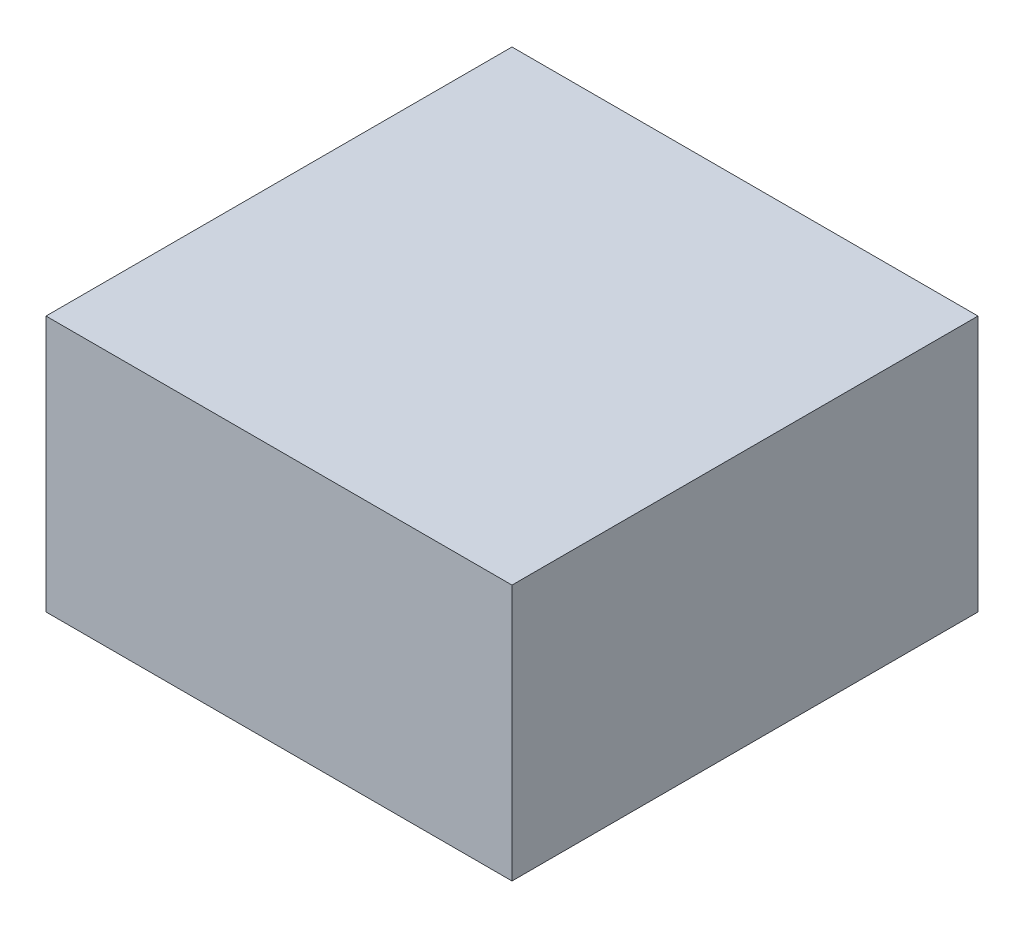
ISO-10303-21;
HEADER;
FILE_DESCRIPTION(('STEP AP214'),'2;1');
FILE_NAME('part.step','',(''),(''),'','','');
FILE_SCHEMA(('AUTOMOTIVE_DESIGN { 1 0 10303 214 1 1 1 1 }'));
ENDSEC;
DATA;
#1=APPLICATION_CONTEXT('core data for automotive mechanical design processes');
#2=APPLICATION_PROTOCOL_DEFINITION('international standard','automotive_design',2000,#1);
#3=PRODUCT_CONTEXT('',#1,'mechanical');
#4=PRODUCT('Part','Part','',(#3));
#5=PRODUCT_RELATED_PRODUCT_CATEGORY('part','',(#4));
#6=PRODUCT_DEFINITION_FORMATION('','',#4);
#7=PRODUCT_DEFINITION_CONTEXT('part definition',#1,'design');
#8=PRODUCT_DEFINITION('design','',#6,#7);
#9=PRODUCT_DEFINITION_SHAPE('','',#8);
#10=(LENGTH_UNIT() NAMED_UNIT(*) SI_UNIT(.MILLI.,.METRE.));
#11=(NAMED_UNIT(*) PLANE_ANGLE_UNIT() SI_UNIT($,.RADIAN.));
#12=(NAMED_UNIT(*) SI_UNIT($,.STERADIAN.) SOLID_ANGLE_UNIT());
#13=UNCERTAINTY_MEASURE_WITH_UNIT(LENGTH_MEASURE(1.E-05),#10,'distance_accuracy_value','');
#14=(GEOMETRIC_REPRESENTATION_CONTEXT(3) GLOBAL_UNCERTAINTY_ASSIGNED_CONTEXT((#13)) GLOBAL_UNIT_ASSIGNED_CONTEXT((#10,
#11,#12)) REPRESENTATION_CONTEXT('',''));
#15=CARTESIAN_POINT('',(0.,0.,0.));
#16=DIRECTION('',(0.,0.,1.));
#17=DIRECTION('',(1.,0.,0.));
#18=AXIS2_PLACEMENT_3D('',#15,#16,#17);
#19=CARTESIAN_POINT('',(0.5,0.55,-0.499999999999999));
#20=DIRECTION('',(-1.,0.,0.));
#21=DIRECTION('',(0.,0.,1.));
#22=AXIS2_PLACEMENT_3D('',#19,#20,#21);
#23=PLANE('',#22);
#24=DIRECTION('',(0.,0.,-1.));
#25=VECTOR('',#24,1.);
#26=CARTESIAN_POINT('',(0.5,0.,-0.499999999999999));
#27=LINE('',#26,#25);
#28=CARTESIAN_POINT('',(0.5,0.,0.500000000000001));
#29=VERTEX_POINT('',#28);
#30=CARTESIAN_POINT('',(0.5,0.,-0.499999999999999));
#31=VERTEX_POINT('',#30);
#32=EDGE_CURVE('E105',#29,#31,#27,.T.);
#33=ORIENTED_EDGE('',*,*,#32,.T.);
#34=DIRECTION('',(0.,-1.,0.));
#35=VECTOR('',#34,1.);
#36=CARTESIAN_POINT('',(0.5,0.55,-0.499999999999999));
#37=LINE('',#36,#35);
#38=CARTESIAN_POINT('',(0.5,0.55,-0.499999999999999));
#39=VERTEX_POINT('',#38);
#40=EDGE_CURVE('E11',#39,#31,#37,.T.);
#41=ORIENTED_EDGE('',*,*,#40,.F.);
#42=DIRECTION('',(0.,0.,-1.));
#43=VECTOR('',#42,1.);
#44=CARTESIAN_POINT('',(0.5,0.55,-0.499999999999999));
#45=LINE('',#44,#43);
#46=CARTESIAN_POINT('',(0.5,0.55,0.500000000000001));
#47=VERTEX_POINT('',#46);
#48=EDGE_CURVE('E88',#47,#39,#45,.T.);
#49=ORIENTED_EDGE('',*,*,#48,.F.);
#50=DIRECTION('',(0.,-1.,0.));
#51=VECTOR('',#50,1.);
#52=CARTESIAN_POINT('',(0.5,0.55,0.500000000000001));
#53=LINE('',#52,#51);
#54=EDGE_CURVE('E101',#47,#29,#53,.T.);
#55=ORIENTED_EDGE('',*,*,#54,.T.);
#56=EDGE_LOOP('',(#33,#41,#49,#55));
#57=FACE_BOUND('',#56,.T.);
#58=ADVANCED_FACE('F36',(#57),#23,.F.);
#59=CARTESIAN_POINT('',(-0.5,0.55,-0.499999999999999));
#60=DIRECTION('',(0.,0.,1.));
#61=DIRECTION('',(1.,0.,0.));
#62=AXIS2_PLACEMENT_3D('',#59,#60,#61);
#63=PLANE('',#62);
#64=DIRECTION('',(-1.,0.,0.));
#65=VECTOR('',#64,1.);
#66=CARTESIAN_POINT('',(-0.5,0.,-0.499999999999999));
#67=LINE('',#66,#65);
#68=CARTESIAN_POINT('',(-0.5,0.,-0.499999999999999));
#69=VERTEX_POINT('',#68);
#70=EDGE_CURVE('E93',#31,#69,#67,.T.);
#71=ORIENTED_EDGE('',*,*,#70,.T.);
#72=DIRECTION('',(0.,-1.,0.));
#73=VECTOR('',#72,1.);
#74=CARTESIAN_POINT('',(-0.5,0.55,-0.499999999999999));
#75=LINE('',#74,#73);
#76=CARTESIAN_POINT('',(-0.5,0.55,-0.499999999999999));
#77=VERTEX_POINT('',#76);
#78=EDGE_CURVE('E45',#77,#69,#75,.T.);
#79=ORIENTED_EDGE('',*,*,#78,.F.);
#80=DIRECTION('',(-1.,0.,0.));
#81=VECTOR('',#80,1.);
#82=CARTESIAN_POINT('',(-0.5,0.55,-0.499999999999999));
#83=LINE('',#82,#81);
#84=EDGE_CURVE('E83',#39,#77,#83,.T.);
#85=ORIENTED_EDGE('',*,*,#84,.F.);
#86=ORIENTED_EDGE('',*,*,#40,.T.);
#87=EDGE_LOOP('',(#71,#79,#85,#86));
#88=FACE_BOUND('',#87,.T.);
#89=ADVANCED_FACE('F92',(#88),#63,.F.);
#90=CARTESIAN_POINT('',(-0.5,0.55,-0.499999999999999));
#91=DIRECTION('',(1.,0.,0.));
#92=DIRECTION('',(0.,0.,-1.));
#93=AXIS2_PLACEMENT_3D('',#90,#91,#92);
#94=PLANE('',#93);
#95=DIRECTION('',(0.,0.,1.));
#96=VECTOR('',#95,1.);
#97=CARTESIAN_POINT('',(-0.5,0.,-0.499999999999999));
#98=LINE('',#97,#96);
#99=CARTESIAN_POINT('',(-0.5,0.,0.500000000000001));
#100=VERTEX_POINT('',#99);
#101=EDGE_CURVE('E70',#69,#100,#98,.T.);
#102=ORIENTED_EDGE('',*,*,#101,.T.);
#103=DIRECTION('',(0.,-1.,0.));
#104=VECTOR('',#103,1.);
#105=CARTESIAN_POINT('',(-0.5,0.55,0.500000000000001));
#106=LINE('',#105,#104);
#107=CARTESIAN_POINT('',(-0.5,0.55,0.500000000000001));
#108=VERTEX_POINT('',#107);
#109=EDGE_CURVE('E95',#108,#100,#106,.T.);
#110=ORIENTED_EDGE('',*,*,#109,.F.);
#111=DIRECTION('',(0.,0.,1.));
#112=VECTOR('',#111,1.);
#113=CARTESIAN_POINT('',(-0.5,0.55,-0.499999999999999));
#114=LINE('',#113,#112);
#115=EDGE_CURVE('E86',#77,#108,#114,.T.);
#116=ORIENTED_EDGE('',*,*,#115,.F.);
#117=ORIENTED_EDGE('',*,*,#78,.T.);
#118=EDGE_LOOP('',(#102,#110,#116,#117));
#119=FACE_BOUND('',#118,.T.);
#120=ADVANCED_FACE('F96',(#119),#94,.F.);
#121=CARTESIAN_POINT('',(-0.5,0.55,0.500000000000001));
#122=DIRECTION('',(0.,0.,-1.));
#123=DIRECTION('',(-1.,0.,0.));
#124=AXIS2_PLACEMENT_3D('',#121,#122,#123);
#125=PLANE('',#124);
#126=DIRECTION('',(1.,0.,0.));
#127=VECTOR('',#126,1.);
#128=CARTESIAN_POINT('',(-0.5,0.,0.500000000000001));
#129=LINE('',#128,#127);
#130=EDGE_CURVE('E76',#100,#29,#129,.T.);
#131=ORIENTED_EDGE('',*,*,#130,.T.);
#132=ORIENTED_EDGE('',*,*,#54,.F.);
#133=DIRECTION('',(1.,0.,0.));
#134=VECTOR('',#133,1.);
#135=CARTESIAN_POINT('',(-0.5,0.55,0.500000000000001));
#136=LINE('',#135,#134);
#137=EDGE_CURVE('E53',#108,#47,#136,.T.);
#138=ORIENTED_EDGE('',*,*,#137,.F.);
#139=ORIENTED_EDGE('',*,*,#109,.T.);
#140=EDGE_LOOP('',(#131,#132,#138,#139));
#141=FACE_BOUND('',#140,.T.);
#142=ADVANCED_FACE('F117',(#141),#125,.F.);
#143=CARTESIAN_POINT('',(0.,0.55,0.));
#144=DIRECTION('',(0.,1.,0.));
#145=DIRECTION('',(0.,0.,1.));
#146=AXIS2_PLACEMENT_3D('',#143,#144,#145);
#147=PLANE('',#146);
#148=ORIENTED_EDGE('',*,*,#48,.T.);
#149=ORIENTED_EDGE('',*,*,#84,.T.);
#150=ORIENTED_EDGE('',*,*,#115,.T.);
#151=ORIENTED_EDGE('',*,*,#137,.T.);
#152=EDGE_LOOP('',(#148,#149,#150,#151));
#153=FACE_BOUND('',#152,.T.);
#154=ADVANCED_FACE('F84',(#153),#147,.T.);
#155=CARTESIAN_POINT('',(0.,0.,0.));
#156=DIRECTION('',(0.,1.,0.));
#157=DIRECTION('',(0.,0.,1.));
#158=AXIS2_PLACEMENT_3D('',#155,#156,#157);
#159=PLANE('',#158);
#160=ORIENTED_EDGE('',*,*,#32,.F.);
#161=ORIENTED_EDGE('',*,*,#130,.F.);
#162=ORIENTED_EDGE('',*,*,#101,.F.);
#163=ORIENTED_EDGE('',*,*,#70,.F.);
#164=EDGE_LOOP('',(#160,#161,#162,#163));
#165=FACE_BOUND('',#164,.T.);
#166=ADVANCED_FACE('F120',(#165),#159,.F.);
#167=CLOSED_SHELL('',(#58,#89,#120,#142,#154,#166));
#168=MANIFOLD_SOLID_BREP('B2',#167);
#169=ADVANCED_BREP_SHAPE_REPRESENTATION('',(#18,#168),#14);
#170=SHAPE_DEFINITION_REPRESENTATION(#9,#169);
ENDSEC;
END-ISO-10303-21;
